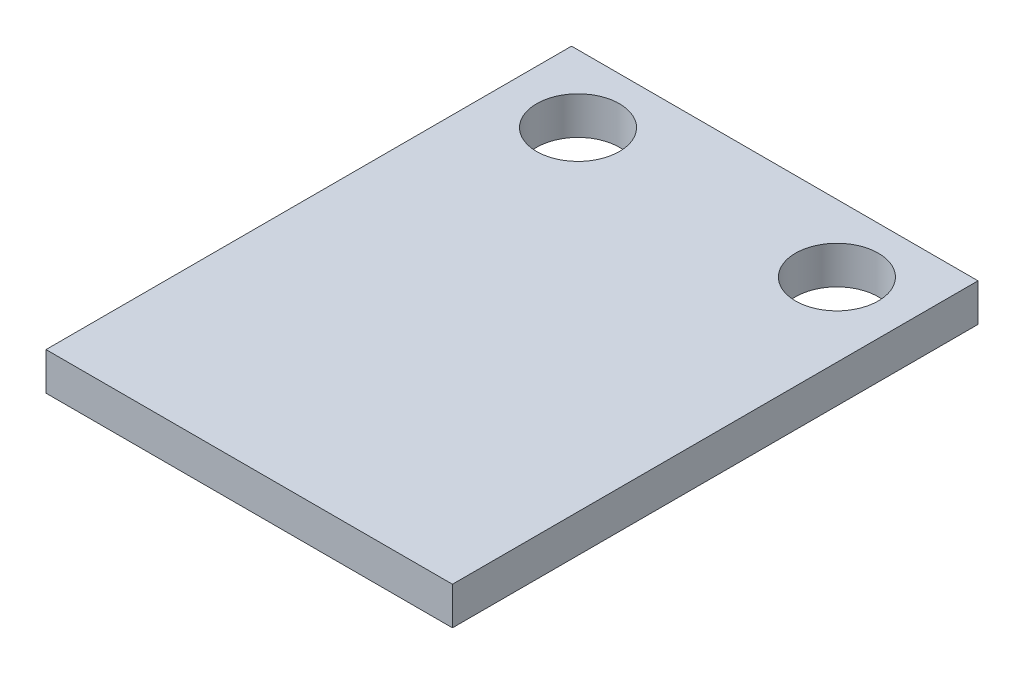
ISO-10303-21;
HEADER;
FILE_DESCRIPTION(('STEP AP214'),'2;1');
FILE_NAME('part.step','',(''),(''),'','','');
FILE_SCHEMA(('AUTOMOTIVE_DESIGN { 1 0 10303 214 1 1 1 1 }'));
ENDSEC;
DATA;
#1=APPLICATION_CONTEXT('core data for automotive mechanical design processes');
#2=APPLICATION_PROTOCOL_DEFINITION('international standard','automotive_design',2000,#1);
#3=PRODUCT_CONTEXT('',#1,'mechanical');
#4=PRODUCT('Part','Part','',(#3));
#5=PRODUCT_RELATED_PRODUCT_CATEGORY('part','',(#4));
#6=PRODUCT_DEFINITION_FORMATION('','',#4);
#7=PRODUCT_DEFINITION_CONTEXT('part definition',#1,'design');
#8=PRODUCT_DEFINITION('design','',#6,#7);
#9=PRODUCT_DEFINITION_SHAPE('','',#8);
#10=(LENGTH_UNIT() NAMED_UNIT(*) SI_UNIT(.MILLI.,.METRE.));
#11=(NAMED_UNIT(*) PLANE_ANGLE_UNIT() SI_UNIT($,.RADIAN.));
#12=(NAMED_UNIT(*) SI_UNIT($,.STERADIAN.) SOLID_ANGLE_UNIT());
#13=UNCERTAINTY_MEASURE_WITH_UNIT(LENGTH_MEASURE(1.E-05),#10,'distance_accuracy_value','');
#14=(GEOMETRIC_REPRESENTATION_CONTEXT(3) GLOBAL_UNCERTAINTY_ASSIGNED_CONTEXT((#13)) GLOBAL_UNIT_ASSIGNED_CONTEXT((#10,
#11,#12)) REPRESENTATION_CONTEXT('',''));
#15=CARTESIAN_POINT('',(0.,0.,0.));
#16=DIRECTION('',(0.,0.,1.));
#17=DIRECTION('',(1.,0.,0.));
#18=AXIS2_PLACEMENT_3D('',#15,#16,#17);
#19=CARTESIAN_POINT('',(0.,1.46,0.));
#20=DIRECTION('',(0.,-1.,0.));
#21=DIRECTION('',(0.,0.,-1.));
#22=AXIS2_PLACEMENT_3D('',#19,#20,#21);
#23=PLANE('',#22);
#24=CARTESIAN_POINT('',(-5.,1.46,-7.55));
#25=DIRECTION('',(0.,1.,0.));
#26=DIRECTION('',(0.,0.,1.));
#27=AXIS2_PLACEMENT_3D('',#24,#25,#26);
#28=CIRCLE('',#27,1.6);
#29=CARTESIAN_POINT('',(-5.,1.46,-5.95));
#30=VERTEX_POINT('',#29);
#31=EDGE_CURVE('E99',#30,#30,#28,.T.);
#32=ORIENTED_EDGE('',*,*,#31,.F.);
#33=EDGE_LOOP('',(#32));
#34=FACE_BOUND('',#33,.T.);
#35=DIRECTION('',(0.,0.,-1.));
#36=VECTOR('',#35,1.);
#37=CARTESIAN_POINT('',(7.85,1.46,10.15));
#38=LINE('',#37,#36);
#39=CARTESIAN_POINT('',(7.85,1.46,10.15));
#40=VERTEX_POINT('',#39);
#41=CARTESIAN_POINT('',(7.85,1.46,-10.15));
#42=VERTEX_POINT('',#41);
#43=EDGE_CURVE('E84',#40,#42,#38,.T.);
#44=ORIENTED_EDGE('',*,*,#43,.T.);
#45=DIRECTION('',(-1.,0.,0.));
#46=VECTOR('',#45,1.);
#47=CARTESIAN_POINT('',(-7.85,1.46,-10.15));
#48=LINE('',#47,#46);
#49=CARTESIAN_POINT('',(-7.85,1.46,-10.15));
#50=VERTEX_POINT('',#49);
#51=EDGE_CURVE('E79',#42,#50,#48,.T.);
#52=ORIENTED_EDGE('',*,*,#51,.T.);
#53=DIRECTION('',(0.,0.,1.));
#54=VECTOR('',#53,1.);
#55=CARTESIAN_POINT('',(-7.85,1.46,10.15));
#56=LINE('',#55,#54);
#57=CARTESIAN_POINT('',(-7.85,1.46,10.15));
#58=VERTEX_POINT('',#57);
#59=EDGE_CURVE('E82',#50,#58,#56,.T.);
#60=ORIENTED_EDGE('',*,*,#59,.T.);
#61=DIRECTION('',(1.,0.,0.));
#62=VECTOR('',#61,1.);
#63=CARTESIAN_POINT('',(-7.85,1.46,10.15));
#64=LINE('',#63,#62);
#65=EDGE_CURVE('E49',#58,#40,#64,.T.);
#66=ORIENTED_EDGE('',*,*,#65,.T.);
#67=EDGE_LOOP('',(#44,#52,#60,#66));
#68=FACE_BOUND('',#67,.T.);
#69=CARTESIAN_POINT('',(5.,1.46,-7.55));
#70=DIRECTION('',(0.,1.,0.));
#71=DIRECTION('',(0.,0.,1.));
#72=AXIS2_PLACEMENT_3D('',#69,#70,#71);
#73=CIRCLE('',#72,1.6);
#74=CARTESIAN_POINT('',(5.,1.46,-5.95));
#75=VERTEX_POINT('',#74);
#76=EDGE_CURVE('E114',#75,#75,#73,.T.);
#77=ORIENTED_EDGE('',*,*,#76,.F.);
#78=EDGE_LOOP('',(#77));
#79=FACE_BOUND('',#78,.T.);
#80=ADVANCED_FACE('F32',(#34,#68,#79),#23,.F.);
#81=CARTESIAN_POINT('',(0.,0.,0.));
#82=DIRECTION('',(0.,-1.,0.));
#83=DIRECTION('',(0.,0.,-1.));
#84=AXIS2_PLACEMENT_3D('',#81,#82,#83);
#85=PLANE('',#84);
#86=CARTESIAN_POINT('',(-5.,0.,-7.55));
#87=DIRECTION('',(0.,1.,0.));
#88=DIRECTION('',(0.,0.,1.));
#89=AXIS2_PLACEMENT_3D('',#86,#87,#88);
#90=CIRCLE('',#89,1.6);
#91=CARTESIAN_POINT('',(-5.,0.,-5.95));
#92=VERTEX_POINT('',#91);
#93=EDGE_CURVE('E111',#92,#92,#90,.T.);
#94=ORIENTED_EDGE('',*,*,#93,.T.);
#95=EDGE_LOOP('',(#94));
#96=FACE_BOUND('',#95,.T.);
#97=DIRECTION('',(0.,0.,-1.));
#98=VECTOR('',#97,1.);
#99=CARTESIAN_POINT('',(7.85,0.,10.15));
#100=LINE('',#99,#98);
#101=CARTESIAN_POINT('',(7.85,0.,10.15));
#102=VERTEX_POINT('',#101);
#103=CARTESIAN_POINT('',(7.85,0.,-10.15));
#104=VERTEX_POINT('',#103);
#105=EDGE_CURVE('E96',#102,#104,#100,.T.);
#106=ORIENTED_EDGE('',*,*,#105,.F.);
#107=DIRECTION('',(1.,0.,0.));
#108=VECTOR('',#107,1.);
#109=CARTESIAN_POINT('',(-7.85,0.,10.15));
#110=LINE('',#109,#108);
#111=CARTESIAN_POINT('',(-7.85,0.,10.15));
#112=VERTEX_POINT('',#111);
#113=EDGE_CURVE('E72',#112,#102,#110,.T.);
#114=ORIENTED_EDGE('',*,*,#113,.F.);
#115=DIRECTION('',(0.,0.,1.));
#116=VECTOR('',#115,1.);
#117=CARTESIAN_POINT('',(-7.85,0.,10.15));
#118=LINE('',#117,#116);
#119=CARTESIAN_POINT('',(-7.85,0.,-10.15));
#120=VERTEX_POINT('',#119);
#121=EDGE_CURVE('E66',#120,#112,#118,.T.);
#122=ORIENTED_EDGE('',*,*,#121,.F.);
#123=DIRECTION('',(-1.,0.,0.));
#124=VECTOR('',#123,1.);
#125=CARTESIAN_POINT('',(-7.85,0.,-10.15));
#126=LINE('',#125,#124);
#127=EDGE_CURVE('E88',#104,#120,#126,.T.);
#128=ORIENTED_EDGE('',*,*,#127,.F.);
#129=EDGE_LOOP('',(#106,#114,#122,#128));
#130=FACE_BOUND('',#129,.T.);
#131=CARTESIAN_POINT('',(5.,0.,-7.55));
#132=DIRECTION('',(0.,1.,0.));
#133=DIRECTION('',(0.,0.,1.));
#134=AXIS2_PLACEMENT_3D('',#131,#132,#133);
#135=CIRCLE('',#134,1.6);
#136=CARTESIAN_POINT('',(5.,0.,-5.95));
#137=VERTEX_POINT('',#136);
#138=EDGE_CURVE('E117',#137,#137,#135,.T.);
#139=ORIENTED_EDGE('',*,*,#138,.T.);
#140=EDGE_LOOP('',(#139));
#141=FACE_BOUND('',#140,.T.);
#142=ADVANCED_FACE('F107',(#96,#130,#141),#85,.T.);
#143=CARTESIAN_POINT('',(7.85,1.46,10.15));
#144=DIRECTION('',(-1.,0.,0.));
#145=DIRECTION('',(0.,0.,1.));
#146=AXIS2_PLACEMENT_3D('',#143,#144,#145);
#147=PLANE('',#146);
#148=ORIENTED_EDGE('',*,*,#105,.T.);
#149=DIRECTION('',(0.,-1.,0.));
#150=VECTOR('',#149,1.);
#151=CARTESIAN_POINT('',(7.85,1.46,-10.15));
#152=LINE('',#151,#150);
#153=EDGE_CURVE('E11',#42,#104,#152,.T.);
#154=ORIENTED_EDGE('',*,*,#153,.F.);
#155=ORIENTED_EDGE('',*,*,#43,.F.);
#156=DIRECTION('',(0.,-1.,0.));
#157=VECTOR('',#156,1.);
#158=CARTESIAN_POINT('',(7.85,1.46,10.15));
#159=LINE('',#158,#157);
#160=EDGE_CURVE('E92',#40,#102,#159,.T.);
#161=ORIENTED_EDGE('',*,*,#160,.T.);
#162=EDGE_LOOP('',(#148,#154,#155,#161));
#163=FACE_BOUND('',#162,.T.);
#164=ADVANCED_FACE('F34',(#163),#147,.F.);
#165=CARTESIAN_POINT('',(-7.85,1.46,-10.15));
#166=DIRECTION('',(0.,0.,1.));
#167=DIRECTION('',(1.,0.,0.));
#168=AXIS2_PLACEMENT_3D('',#165,#166,#167);
#169=PLANE('',#168);
#170=ORIENTED_EDGE('',*,*,#127,.T.);
#171=DIRECTION('',(0.,-1.,0.));
#172=VECTOR('',#171,1.);
#173=CARTESIAN_POINT('',(-7.85,1.46,-10.15));
#174=LINE('',#173,#172);
#175=EDGE_CURVE('E41',#50,#120,#174,.T.);
#176=ORIENTED_EDGE('',*,*,#175,.F.);
#177=ORIENTED_EDGE('',*,*,#51,.F.);
#178=ORIENTED_EDGE('',*,*,#153,.T.);
#179=EDGE_LOOP('',(#170,#176,#177,#178));
#180=FACE_BOUND('',#179,.T.);
#181=ADVANCED_FACE('F87',(#180),#169,.F.);
#182=CARTESIAN_POINT('',(-7.85,1.46,10.15));
#183=DIRECTION('',(1.,0.,0.));
#184=DIRECTION('',(0.,0.,-1.));
#185=AXIS2_PLACEMENT_3D('',#182,#183,#184);
#186=PLANE('',#185);
#187=ORIENTED_EDGE('',*,*,#121,.T.);
#188=DIRECTION('',(0.,-1.,0.));
#189=VECTOR('',#188,1.);
#190=CARTESIAN_POINT('',(-7.85,1.46,10.15));
#191=LINE('',#190,#189);
#192=EDGE_CURVE('E89',#58,#112,#191,.T.);
#193=ORIENTED_EDGE('',*,*,#192,.F.);
#194=ORIENTED_EDGE('',*,*,#59,.F.);
#195=ORIENTED_EDGE('',*,*,#175,.T.);
#196=EDGE_LOOP('',(#187,#193,#194,#195));
#197=FACE_BOUND('',#196,.T.);
#198=ADVANCED_FACE('F90',(#197),#186,.F.);
#199=CARTESIAN_POINT('',(-7.85,1.46,10.15));
#200=DIRECTION('',(0.,0.,-1.));
#201=DIRECTION('',(-1.,0.,0.));
#202=AXIS2_PLACEMENT_3D('',#199,#200,#201);
#203=PLANE('',#202);
#204=ORIENTED_EDGE('',*,*,#113,.T.);
#205=ORIENTED_EDGE('',*,*,#160,.F.);
#206=ORIENTED_EDGE('',*,*,#65,.F.);
#207=ORIENTED_EDGE('',*,*,#192,.T.);
#208=EDGE_LOOP('',(#204,#205,#206,#207));
#209=FACE_BOUND('',#208,.T.);
#210=ADVANCED_FACE('F104',(#209),#203,.F.);
#211=CARTESIAN_POINT('',(-5.,1.46,-7.55));
#212=DIRECTION('',(0.,-1.,0.));
#213=DIRECTION('',(0.,0.,-1.));
#214=AXIS2_PLACEMENT_3D('',#211,#212,#213);
#215=CYLINDRICAL_SURFACE('',#214,1.6);
#216=ORIENTED_EDGE('',*,*,#31,.T.);
#217=EDGE_LOOP('',(#216));
#218=FACE_BOUND('',#217,.T.);
#219=ORIENTED_EDGE('',*,*,#93,.F.);
#220=EDGE_LOOP('',(#219));
#221=FACE_BOUND('',#220,.T.);
#222=ADVANCED_FACE('F135',(#218,#221),#215,.F.);
#223=CARTESIAN_POINT('',(5.,1.46,-7.55));
#224=DIRECTION('',(0.,-1.,0.));
#225=DIRECTION('',(0.,0.,-1.));
#226=AXIS2_PLACEMENT_3D('',#223,#224,#225);
#227=CYLINDRICAL_SURFACE('',#226,1.6);
#228=ORIENTED_EDGE('',*,*,#76,.T.);
#229=EDGE_LOOP('',(#228));
#230=FACE_BOUND('',#229,.T.);
#231=ORIENTED_EDGE('',*,*,#138,.F.);
#232=EDGE_LOOP('',(#231));
#233=FACE_BOUND('',#232,.T.);
#234=ADVANCED_FACE('F123',(#230,#233),#227,.F.);
#235=CLOSED_SHELL('',(#80,#142,#164,#181,#198,#210,#222,#234));
#236=MANIFOLD_SOLID_BREP('B2',#235);
#237=ADVANCED_BREP_SHAPE_REPRESENTATION('',(#18,#236),#14);
#238=SHAPE_DEFINITION_REPRESENTATION(#9,#237);
ENDSEC;
END-ISO-10303-21;
